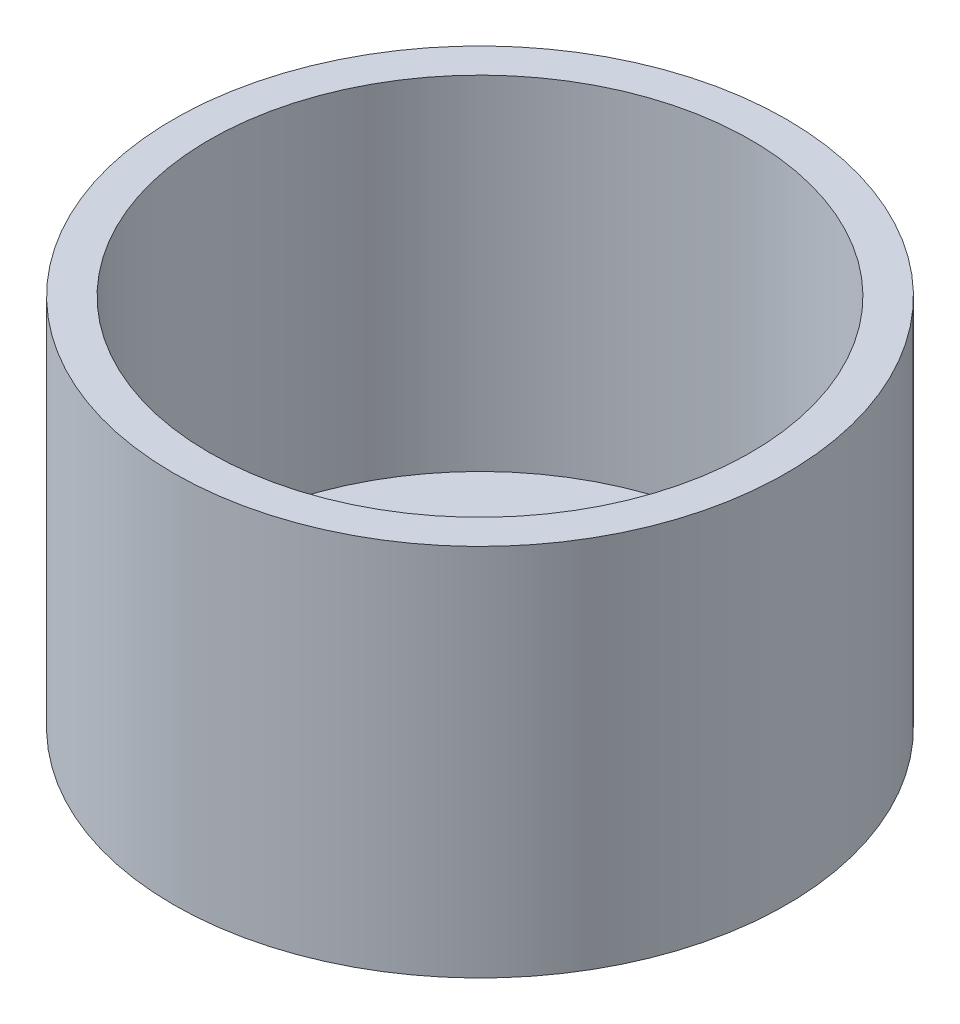
ISO-10303-21;
HEADER;
FILE_DESCRIPTION(('STEP AP214'),'2;1');
FILE_NAME('part.step','',(''),(''),'','','');
FILE_SCHEMA(('AUTOMOTIVE_DESIGN { 1 0 10303 214 1 1 1 1 }'));
ENDSEC;
DATA;
#1=APPLICATION_CONTEXT('core data for automotive mechanical design processes');
#2=APPLICATION_PROTOCOL_DEFINITION('international standard','automotive_design',2000,#1);
#3=PRODUCT_CONTEXT('',#1,'mechanical');
#4=PRODUCT('Part','Part','',(#3));
#5=PRODUCT_RELATED_PRODUCT_CATEGORY('part','',(#4));
#6=PRODUCT_DEFINITION_FORMATION('','',#4);
#7=PRODUCT_DEFINITION_CONTEXT('part definition',#1,'design');
#8=PRODUCT_DEFINITION('design','',#6,#7);
#9=PRODUCT_DEFINITION_SHAPE('','',#8);
#10=(LENGTH_UNIT() NAMED_UNIT(*) SI_UNIT(.MILLI.,.METRE.));
#11=(NAMED_UNIT(*) PLANE_ANGLE_UNIT() SI_UNIT($,.RADIAN.));
#12=(NAMED_UNIT(*) SI_UNIT($,.STERADIAN.) SOLID_ANGLE_UNIT());
#13=UNCERTAINTY_MEASURE_WITH_UNIT(LENGTH_MEASURE(1.E-05),#10,'distance_accuracy_value','');
#14=(GEOMETRIC_REPRESENTATION_CONTEXT(3) GLOBAL_UNCERTAINTY_ASSIGNED_CONTEXT((#13)) GLOBAL_UNIT_ASSIGNED_CONTEXT((#10,
#11,#12)) REPRESENTATION_CONTEXT('',''));
#15=CARTESIAN_POINT('',(0.,0.,0.));
#16=DIRECTION('',(0.,0.,1.));
#17=DIRECTION('',(1.,0.,0.));
#18=AXIS2_PLACEMENT_3D('',#15,#16,#17);
#19=CARTESIAN_POINT('',(0.,57.15,0.));
#20=DIRECTION('',(0.,1.,0.));
#21=DIRECTION('',(0.,0.,1.));
#22=AXIS2_PLACEMENT_3D('',#19,#20,#21);
#23=PLANE('',#22);
#24=CARTESIAN_POINT('',(0.,57.15,0.));
#25=DIRECTION('',(0.,1.,0.));
#26=DIRECTION('',(0.,0.,1.));
#27=AXIS2_PLACEMENT_3D('',#24,#25,#26);
#28=CIRCLE('',#27,51.0286);
#29=CARTESIAN_POINT('',(0.,57.15,51.0286));
#30=VERTEX_POINT('',#29);
#31=EDGE_CURVE('E10',#30,#30,#28,.T.);
#32=ORIENTED_EDGE('',*,*,#31,.T.);
#33=EDGE_LOOP('',(#32));
#34=FACE_BOUND('',#33,.T.);
#35=CARTESIAN_POINT('',(0.,57.15,0.));
#36=DIRECTION('',(0.,1.,0.));
#37=DIRECTION('',(0.,0.,1.));
#38=AXIS2_PLACEMENT_3D('',#35,#36,#37);
#39=CIRCLE('',#38,45.085);
#40=CARTESIAN_POINT('',(0.,57.15,45.085));
#41=VERTEX_POINT('',#40);
#42=EDGE_CURVE('E38',#41,#41,#39,.T.);
#43=ORIENTED_EDGE('',*,*,#42,.F.);
#44=EDGE_LOOP('',(#43));
#45=FACE_BOUND('',#44,.T.);
#46=ADVANCED_FACE('F30',(#34,#45),#23,.T.);
#47=CARTESIAN_POINT('',(0.,57.15,0.));
#48=DIRECTION('',(0.,-1.,0.));
#49=DIRECTION('',(0.,0.,-1.));
#50=AXIS2_PLACEMENT_3D('',#47,#48,#49);
#51=CYLINDRICAL_SURFACE('',#50,51.0286);
#52=ORIENTED_EDGE('',*,*,#31,.F.);
#53=EDGE_LOOP('',(#52));
#54=FACE_BOUND('',#53,.T.);
#55=CARTESIAN_POINT('',(0.,-5.08,0.));
#56=DIRECTION('',(0.,-1.,0.));
#57=DIRECTION('',(0.,0.,-1.));
#58=AXIS2_PLACEMENT_3D('',#55,#56,#57);
#59=CIRCLE('',#58,51.0286);
#60=CARTESIAN_POINT('',(0.,-5.08,-51.0286));
#61=VERTEX_POINT('',#60);
#62=EDGE_CURVE('E119',#61,#61,#59,.T.);
#63=ORIENTED_EDGE('',*,*,#62,.F.);
#64=EDGE_LOOP('',(#63));
#65=FACE_BOUND('',#64,.T.);
#66=ADVANCED_FACE('F32',(#54,#65),#51,.T.);
#67=CARTESIAN_POINT('',(0.,57.15,0.));
#68=DIRECTION('',(0.,-1.,0.));
#69=DIRECTION('',(0.,0.,-1.));
#70=AXIS2_PLACEMENT_3D('',#67,#68,#69);
#71=CYLINDRICAL_SURFACE('',#70,45.085);
#72=ORIENTED_EDGE('',*,*,#42,.T.);
#73=EDGE_LOOP('',(#72));
#74=FACE_BOUND('',#73,.T.);
#75=CARTESIAN_POINT('',(0.,0.,0.));
#76=DIRECTION('',(0.,1.,0.));
#77=DIRECTION('',(0.,0.,1.));
#78=AXIS2_PLACEMENT_3D('',#75,#76,#77);
#79=CIRCLE('',#78,45.085);
#80=CARTESIAN_POINT('',(0.,0.,45.085));
#81=VERTEX_POINT('',#80);
#82=EDGE_CURVE('E43',#81,#81,#79,.T.);
#83=ORIENTED_EDGE('',*,*,#82,.F.);
#84=EDGE_LOOP('',(#83));
#85=FACE_BOUND('',#84,.T.);
#86=ADVANCED_FACE('F128',(#74,#85),#71,.F.);
#87=CARTESIAN_POINT('',(0.,0.,0.));
#88=DIRECTION('',(0.,-1.,0.));
#89=DIRECTION('',(0.,0.,-1.));
#90=AXIS2_PLACEMENT_3D('',#87,#88,#89);
#91=PLANE('',#90);
#92=CARTESIAN_POINT('',(14.050000033,0.,-7.35000003199999));
#93=DIRECTION('',(0.,-1.,0.));
#94=DIRECTION('',(0.,0.,-1.));
#95=AXIS2_PLACEMENT_3D('',#92,#93,#94);
#96=CIRCLE('',#95,1.);
#97=CARTESIAN_POINT('',(14.050000033,0.,-8.35000003199999));
#98=VERTEX_POINT('',#97);
#99=EDGE_CURVE('E116',#98,#98,#96,.T.);
#100=ORIENTED_EDGE('',*,*,#99,.T.);
#101=EDGE_LOOP('',(#100));
#102=FACE_BOUND('',#101,.T.);
#103=CARTESIAN_POINT('',(14.050000033,0.,-12.350000032));
#104=DIRECTION('',(0.,-1.,0.));
#105=DIRECTION('',(0.,0.,-1.));
#106=AXIS2_PLACEMENT_3D('',#103,#104,#105);
#107=CIRCLE('',#106,1.);
#108=CARTESIAN_POINT('',(14.050000033,0.,-13.350000032));
#109=VERTEX_POINT('',#108);
#110=EDGE_CURVE('E104',#109,#109,#107,.T.);
#111=ORIENTED_EDGE('',*,*,#110,.T.);
#112=EDGE_LOOP('',(#111));
#113=FACE_BOUND('',#112,.T.);
#114=CARTESIAN_POINT('',(-14.049999967,0.,-12.350000032));
#115=DIRECTION('',(0.,-1.,0.));
#116=DIRECTION('',(0.,0.,-1.));
#117=AXIS2_PLACEMENT_3D('',#114,#115,#116);
#118=CIRCLE('',#117,0.999999999999998);
#119=CARTESIAN_POINT('',(-14.049999967,0.,-13.350000032));
#120=VERTEX_POINT('',#119);
#121=EDGE_CURVE('E101',#120,#120,#118,.T.);
#122=ORIENTED_EDGE('',*,*,#121,.T.);
#123=EDGE_LOOP('',(#122));
#124=FACE_BOUND('',#123,.T.);
#125=CARTESIAN_POINT('',(-19.049999967,0.,-12.350000032));
#126=DIRECTION('',(0.,-1.,0.));
#127=DIRECTION('',(0.,0.,-1.));
#128=AXIS2_PLACEMENT_3D('',#125,#126,#127);
#129=CIRCLE('',#128,0.999999999999998);
#130=CARTESIAN_POINT('',(-19.049999967,0.,-13.350000032));
#131=VERTEX_POINT('',#130);
#132=EDGE_CURVE('E98',#131,#131,#129,.T.);
#133=ORIENTED_EDGE('',*,*,#132,.T.);
#134=EDGE_LOOP('',(#133));
#135=FACE_BOUND('',#134,.T.);
#136=CARTESIAN_POINT('',(-19.049999967,0.,-7.35000003199999));
#137=DIRECTION('',(0.,-1.,0.));
#138=DIRECTION('',(0.,0.,-1.));
#139=AXIS2_PLACEMENT_3D('',#136,#137,#138);
#140=CIRCLE('',#139,0.999999999999998);
#141=CARTESIAN_POINT('',(-19.049999967,0.,-8.35000003199999));
#142=VERTEX_POINT('',#141);
#143=EDGE_CURVE('E94',#142,#142,#140,.T.);
#144=ORIENTED_EDGE('',*,*,#143,.T.);
#145=EDGE_LOOP('',(#144));
#146=FACE_BOUND('',#145,.T.);
#147=CARTESIAN_POINT('',(-19.049999967,0.,7.34999996800005));
#148=DIRECTION('',(0.,-1.,0.));
#149=DIRECTION('',(0.,0.,-1.));
#150=AXIS2_PLACEMENT_3D('',#147,#148,#149);
#151=CIRCLE('',#150,0.999999999999998);
#152=CARTESIAN_POINT('',(-19.049999967,0.,6.34999996800006));
#153=VERTEX_POINT('',#152);
#154=EDGE_CURVE('E90',#153,#153,#151,.T.);
#155=ORIENTED_EDGE('',*,*,#154,.T.);
#156=EDGE_LOOP('',(#155));
#157=FACE_BOUND('',#156,.T.);
#158=CARTESIAN_POINT('',(-19.049999967,0.,12.349999968));
#159=DIRECTION('',(0.,-1.,0.));
#160=DIRECTION('',(0.,0.,-1.));
#161=AXIS2_PLACEMENT_3D('',#158,#159,#160);
#162=CIRCLE('',#161,0.999999999999998);
#163=CARTESIAN_POINT('',(-19.049999967,0.,11.349999968));
#164=VERTEX_POINT('',#163);
#165=EDGE_CURVE('E86',#164,#164,#162,.T.);
#166=ORIENTED_EDGE('',*,*,#165,.T.);
#167=EDGE_LOOP('',(#166));
#168=FACE_BOUND('',#167,.T.);
#169=CARTESIAN_POINT('',(-14.049999967,0.,12.349999968));
#170=DIRECTION('',(0.,-1.,0.));
#171=DIRECTION('',(0.,0.,-1.));
#172=AXIS2_PLACEMENT_3D('',#169,#170,#171);
#173=CIRCLE('',#172,1.00000000000001);
#174=CARTESIAN_POINT('',(-14.049999967,0.,11.349999968));
#175=VERTEX_POINT('',#174);
#176=EDGE_CURVE('E82',#175,#175,#173,.T.);
#177=ORIENTED_EDGE('',*,*,#176,.T.);
#178=EDGE_LOOP('',(#177));
#179=FACE_BOUND('',#178,.T.);
#180=CARTESIAN_POINT('',(-14.049999967,0.,-7.350000032));
#181=DIRECTION('',(0.,-1.,0.));
#182=DIRECTION('',(0.,0.,-1.));
#183=AXIS2_PLACEMENT_3D('',#180,#181,#182);
#184=CIRCLE('',#183,0.999999999999998);
#185=CARTESIAN_POINT('',(-14.049999967,0.,-8.350000032));
#186=VERTEX_POINT('',#185);
#187=EDGE_CURVE('E78',#186,#186,#184,.T.);
#188=ORIENTED_EDGE('',*,*,#187,.T.);
#189=EDGE_LOOP('',(#188));
#190=FACE_BOUND('',#189,.T.);
#191=CARTESIAN_POINT('',(19.050000033,0.,12.349999968));
#192=DIRECTION('',(0.,-1.,0.));
#193=DIRECTION('',(0.,0.,-1.));
#194=AXIS2_PLACEMENT_3D('',#191,#192,#193);
#195=CIRCLE('',#194,1.);
#196=CARTESIAN_POINT('',(19.050000033,0.,11.349999968));
#197=VERTEX_POINT('',#196);
#198=EDGE_CURVE('E74',#197,#197,#195,.T.);
#199=ORIENTED_EDGE('',*,*,#198,.T.);
#200=EDGE_LOOP('',(#199));
#201=FACE_BOUND('',#200,.T.);
#202=CARTESIAN_POINT('',(14.050000033,0.,12.349999968));
#203=DIRECTION('',(0.,-1.,0.));
#204=DIRECTION('',(0.,0.,-1.));
#205=AXIS2_PLACEMENT_3D('',#202,#203,#204);
#206=CIRCLE('',#205,0.999999999999984);
#207=CARTESIAN_POINT('',(14.050000033,0.,11.349999968));
#208=VERTEX_POINT('',#207);
#209=EDGE_CURVE('E70',#208,#208,#206,.T.);
#210=ORIENTED_EDGE('',*,*,#209,.T.);
#211=EDGE_LOOP('',(#210));
#212=FACE_BOUND('',#211,.T.);
#213=CARTESIAN_POINT('',(14.050000033,0.,7.34999996800004));
#214=DIRECTION('',(0.,-1.,0.));
#215=DIRECTION('',(0.,0.,-1.));
#216=AXIS2_PLACEMENT_3D('',#213,#214,#215);
#217=CIRCLE('',#216,1.);
#218=CARTESIAN_POINT('',(14.050000033,0.,6.34999996800004));
#219=VERTEX_POINT('',#218);
#220=EDGE_CURVE('E66',#219,#219,#217,.T.);
#221=ORIENTED_EDGE('',*,*,#220,.T.);
#222=EDGE_LOOP('',(#221));
#223=FACE_BOUND('',#222,.T.);
#224=CARTESIAN_POINT('',(19.050000033,0.,7.34999996800004));
#225=DIRECTION('',(0.,-1.,0.));
#226=DIRECTION('',(0.,0.,-1.));
#227=AXIS2_PLACEMENT_3D('',#224,#225,#226);
#228=CIRCLE('',#227,1.);
#229=CARTESIAN_POINT('',(19.050000033,0.,6.34999996800004));
#230=VERTEX_POINT('',#229);
#231=EDGE_CURVE('E62',#230,#230,#228,.T.);
#232=ORIENTED_EDGE('',*,*,#231,.T.);
#233=EDGE_LOOP('',(#232));
#234=FACE_BOUND('',#233,.T.);
#235=CARTESIAN_POINT('',(19.050000033,0.,-7.35000003199998));
#236=DIRECTION('',(0.,-1.,0.));
#237=DIRECTION('',(0.,0.,-1.));
#238=AXIS2_PLACEMENT_3D('',#235,#236,#237);
#239=CIRCLE('',#238,0.999999999999998);
#240=CARTESIAN_POINT('',(19.050000033,0.,-8.35000003199998));
#241=VERTEX_POINT('',#240);
#242=EDGE_CURVE('E58',#241,#241,#239,.T.);
#243=ORIENTED_EDGE('',*,*,#242,.T.);
#244=EDGE_LOOP('',(#243));
#245=FACE_BOUND('',#244,.T.);
#246=CARTESIAN_POINT('',(19.050000033,0.,-12.350000032));
#247=DIRECTION('',(0.,-1.,0.));
#248=DIRECTION('',(0.,0.,-1.));
#249=AXIS2_PLACEMENT_3D('',#246,#247,#248);
#250=CIRCLE('',#249,1.);
#251=CARTESIAN_POINT('',(19.050000033,0.,-13.350000032));
#252=VERTEX_POINT('',#251);
#253=EDGE_CURVE('E54',#252,#252,#250,.T.);
#254=ORIENTED_EDGE('',*,*,#253,.T.);
#255=EDGE_LOOP('',(#254));
#256=FACE_BOUND('',#255,.T.);
#257=CARTESIAN_POINT('',(-14.049999967,0.,7.34999996800005));
#258=DIRECTION('',(0.,-1.,0.));
#259=DIRECTION('',(0.,0.,-1.));
#260=AXIS2_PLACEMENT_3D('',#257,#258,#259);
#261=CIRCLE('',#260,1.00000000000001);
#262=CARTESIAN_POINT('',(-14.049999967,0.,6.34999996800004));
#263=VERTEX_POINT('',#262);
#264=EDGE_CURVE('E50',#263,#263,#261,.T.);
#265=ORIENTED_EDGE('',*,*,#264,.T.);
#266=EDGE_LOOP('',(#265));
#267=FACE_BOUND('',#266,.T.);
#268=ORIENTED_EDGE('',*,*,#82,.T.);
#269=EDGE_LOOP('',(#268));
#270=FACE_BOUND('',#269,.T.);
#271=ADVANCED_FACE('F126',(#102,#113,#124,#135,#146,#157,#168,#179,#190,#201,#212,#223,#234,
#245,#256,#267,#270),#91,.F.);
#272=CARTESIAN_POINT('',(0.,-5.08,0.));
#273=DIRECTION('',(0.,-1.,0.));
#274=DIRECTION('',(0.,0.,-1.));
#275=AXIS2_PLACEMENT_3D('',#272,#273,#274);
#276=PLANE('',#275);
#277=CARTESIAN_POINT('',(14.050000033,-5.08,-7.35000003199999));
#278=DIRECTION('',(0.,-1.,0.));
#279=DIRECTION('',(0.,0.,-1.));
#280=AXIS2_PLACEMENT_3D('',#277,#278,#279);
#281=CIRCLE('',#280,1.);
#282=CARTESIAN_POINT('',(14.050000033,-5.08,-8.35000003199999));
#283=VERTEX_POINT('',#282);
#284=EDGE_CURVE('E34',#283,#283,#281,.T.);
#285=ORIENTED_EDGE('',*,*,#284,.F.);
#286=EDGE_LOOP('',(#285));
#287=FACE_BOUND('',#286,.T.);
#288=CARTESIAN_POINT('',(14.050000033,-5.08,-12.350000032));
#289=DIRECTION('',(0.,-1.,0.));
#290=DIRECTION('',(0.,0.,-1.));
#291=AXIS2_PLACEMENT_3D('',#288,#289,#290);
#292=CIRCLE('',#291,1.);
#293=CARTESIAN_POINT('',(14.050000033,-5.08,-13.350000032));
#294=VERTEX_POINT('',#293);
#295=EDGE_CURVE('E102',#294,#294,#292,.T.);
#296=ORIENTED_EDGE('',*,*,#295,.F.);
#297=EDGE_LOOP('',(#296));
#298=FACE_BOUND('',#297,.T.);
#299=CARTESIAN_POINT('',(-14.049999967,-5.08,-12.350000032));
#300=DIRECTION('',(0.,-1.,0.));
#301=DIRECTION('',(0.,0.,-1.));
#302=AXIS2_PLACEMENT_3D('',#299,#300,#301);
#303=CIRCLE('',#302,0.999999999999998);
#304=CARTESIAN_POINT('',(-14.049999967,-5.08,-13.350000032));
#305=VERTEX_POINT('',#304);
#306=EDGE_CURVE('E99',#305,#305,#303,.T.);
#307=ORIENTED_EDGE('',*,*,#306,.F.);
#308=EDGE_LOOP('',(#307));
#309=FACE_BOUND('',#308,.T.);
#310=CARTESIAN_POINT('',(-19.049999967,-5.08,-12.350000032));
#311=DIRECTION('',(0.,-1.,0.));
#312=DIRECTION('',(0.,0.,-1.));
#313=AXIS2_PLACEMENT_3D('',#310,#311,#312);
#314=CIRCLE('',#313,0.999999999999998);
#315=CARTESIAN_POINT('',(-19.049999967,-5.08,-13.350000032));
#316=VERTEX_POINT('',#315);
#317=EDGE_CURVE('E95',#316,#316,#314,.T.);
#318=ORIENTED_EDGE('',*,*,#317,.F.);
#319=EDGE_LOOP('',(#318));
#320=FACE_BOUND('',#319,.T.);
#321=CARTESIAN_POINT('',(-19.049999967,-5.08,-7.35000003199999));
#322=DIRECTION('',(0.,-1.,0.));
#323=DIRECTION('',(0.,0.,-1.));
#324=AXIS2_PLACEMENT_3D('',#321,#322,#323);
#325=CIRCLE('',#324,0.999999999999998);
#326=CARTESIAN_POINT('',(-19.049999967,-5.08,-8.35000003199999));
#327=VERTEX_POINT('',#326);
#328=EDGE_CURVE('E91',#327,#327,#325,.T.);
#329=ORIENTED_EDGE('',*,*,#328,.F.);
#330=EDGE_LOOP('',(#329));
#331=FACE_BOUND('',#330,.T.);
#332=CARTESIAN_POINT('',(-19.049999967,-5.08,7.34999996800005));
#333=DIRECTION('',(0.,-1.,0.));
#334=DIRECTION('',(0.,0.,-1.));
#335=AXIS2_PLACEMENT_3D('',#332,#333,#334);
#336=CIRCLE('',#335,0.999999999999998);
#337=CARTESIAN_POINT('',(-19.049999967,-5.08,6.34999996800006));
#338=VERTEX_POINT('',#337);
#339=EDGE_CURVE('E87',#338,#338,#336,.T.);
#340=ORIENTED_EDGE('',*,*,#339,.F.);
#341=EDGE_LOOP('',(#340));
#342=FACE_BOUND('',#341,.T.);
#343=CARTESIAN_POINT('',(-19.049999967,-5.08,12.349999968));
#344=DIRECTION('',(0.,-1.,0.));
#345=DIRECTION('',(0.,0.,-1.));
#346=AXIS2_PLACEMENT_3D('',#343,#344,#345);
#347=CIRCLE('',#346,0.999999999999998);
#348=CARTESIAN_POINT('',(-19.049999967,-5.08,11.349999968));
#349=VERTEX_POINT('',#348);
#350=EDGE_CURVE('E83',#349,#349,#347,.T.);
#351=ORIENTED_EDGE('',*,*,#350,.F.);
#352=EDGE_LOOP('',(#351));
#353=FACE_BOUND('',#352,.T.);
#354=CARTESIAN_POINT('',(-14.049999967,-5.08,12.349999968));
#355=DIRECTION('',(0.,-1.,0.));
#356=DIRECTION('',(0.,0.,-1.));
#357=AXIS2_PLACEMENT_3D('',#354,#355,#356);
#358=CIRCLE('',#357,1.00000000000001);
#359=CARTESIAN_POINT('',(-14.049999967,-5.08,11.349999968));
#360=VERTEX_POINT('',#359);
#361=EDGE_CURVE('E79',#360,#360,#358,.T.);
#362=ORIENTED_EDGE('',*,*,#361,.F.);
#363=EDGE_LOOP('',(#362));
#364=FACE_BOUND('',#363,.T.);
#365=CARTESIAN_POINT('',(-14.049999967,-5.08,-7.350000032));
#366=DIRECTION('',(0.,-1.,0.));
#367=DIRECTION('',(0.,0.,-1.));
#368=AXIS2_PLACEMENT_3D('',#365,#366,#367);
#369=CIRCLE('',#368,0.999999999999998);
#370=CARTESIAN_POINT('',(-14.049999967,-5.08,-8.350000032));
#371=VERTEX_POINT('',#370);
#372=EDGE_CURVE('E75',#371,#371,#369,.T.);
#373=ORIENTED_EDGE('',*,*,#372,.F.);
#374=EDGE_LOOP('',(#373));
#375=FACE_BOUND('',#374,.T.);
#376=CARTESIAN_POINT('',(19.050000033,-5.08,12.349999968));
#377=DIRECTION('',(0.,-1.,0.));
#378=DIRECTION('',(0.,0.,-1.));
#379=AXIS2_PLACEMENT_3D('',#376,#377,#378);
#380=CIRCLE('',#379,1.);
#381=CARTESIAN_POINT('',(19.050000033,-5.08,11.349999968));
#382=VERTEX_POINT('',#381);
#383=EDGE_CURVE('E71',#382,#382,#380,.T.);
#384=ORIENTED_EDGE('',*,*,#383,.F.);
#385=EDGE_LOOP('',(#384));
#386=FACE_BOUND('',#385,.T.);
#387=CARTESIAN_POINT('',(14.050000033,-5.08,12.349999968));
#388=DIRECTION('',(0.,-1.,0.));
#389=DIRECTION('',(0.,0.,-1.));
#390=AXIS2_PLACEMENT_3D('',#387,#388,#389);
#391=CIRCLE('',#390,0.999999999999984);
#392=CARTESIAN_POINT('',(14.050000033,-5.08,11.349999968));
#393=VERTEX_POINT('',#392);
#394=EDGE_CURVE('E67',#393,#393,#391,.T.);
#395=ORIENTED_EDGE('',*,*,#394,.F.);
#396=EDGE_LOOP('',(#395));
#397=FACE_BOUND('',#396,.T.);
#398=CARTESIAN_POINT('',(14.050000033,-5.08,7.34999996800004));
#399=DIRECTION('',(0.,-1.,0.));
#400=DIRECTION('',(0.,0.,-1.));
#401=AXIS2_PLACEMENT_3D('',#398,#399,#400);
#402=CIRCLE('',#401,1.);
#403=CARTESIAN_POINT('',(14.050000033,-5.08,6.34999996800004));
#404=VERTEX_POINT('',#403);
#405=EDGE_CURVE('E63',#404,#404,#402,.T.);
#406=ORIENTED_EDGE('',*,*,#405,.F.);
#407=EDGE_LOOP('',(#406));
#408=FACE_BOUND('',#407,.T.);
#409=CARTESIAN_POINT('',(19.050000033,-5.08,7.34999996800004));
#410=DIRECTION('',(0.,-1.,0.));
#411=DIRECTION('',(0.,0.,-1.));
#412=AXIS2_PLACEMENT_3D('',#409,#410,#411);
#413=CIRCLE('',#412,1.);
#414=CARTESIAN_POINT('',(19.050000033,-5.08,6.34999996800004));
#415=VERTEX_POINT('',#414);
#416=EDGE_CURVE('E59',#415,#415,#413,.T.);
#417=ORIENTED_EDGE('',*,*,#416,.F.);
#418=EDGE_LOOP('',(#417));
#419=FACE_BOUND('',#418,.T.);
#420=CARTESIAN_POINT('',(19.050000033,-5.08,-7.35000003199998));
#421=DIRECTION('',(0.,-1.,0.));
#422=DIRECTION('',(0.,0.,-1.));
#423=AXIS2_PLACEMENT_3D('',#420,#421,#422);
#424=CIRCLE('',#423,0.999999999999998);
#425=CARTESIAN_POINT('',(19.050000033,-5.08,-8.35000003199998));
#426=VERTEX_POINT('',#425);
#427=EDGE_CURVE('E55',#426,#426,#424,.T.);
#428=ORIENTED_EDGE('',*,*,#427,.F.);
#429=EDGE_LOOP('',(#428));
#430=FACE_BOUND('',#429,.T.);
#431=CARTESIAN_POINT('',(19.050000033,-5.08,-12.350000032));
#432=DIRECTION('',(0.,-1.,0.));
#433=DIRECTION('',(0.,0.,-1.));
#434=AXIS2_PLACEMENT_3D('',#431,#432,#433);
#435=CIRCLE('',#434,1.);
#436=CARTESIAN_POINT('',(19.050000033,-5.08,-13.350000032));
#437=VERTEX_POINT('',#436);
#438=EDGE_CURVE('E51',#437,#437,#435,.T.);
#439=ORIENTED_EDGE('',*,*,#438,.F.);
#440=EDGE_LOOP('',(#439));
#441=FACE_BOUND('',#440,.T.);
#442=CARTESIAN_POINT('',(-14.049999967,-5.08,7.34999996800005));
#443=DIRECTION('',(0.,-1.,0.));
#444=DIRECTION('',(0.,0.,-1.));
#445=AXIS2_PLACEMENT_3D('',#442,#443,#444);
#446=CIRCLE('',#445,1.00000000000001);
#447=CARTESIAN_POINT('',(-14.049999967,-5.08,6.34999996800004));
#448=VERTEX_POINT('',#447);
#449=EDGE_CURVE('E47',#448,#448,#446,.T.);
#450=ORIENTED_EDGE('',*,*,#449,.F.);
#451=EDGE_LOOP('',(#450));
#452=FACE_BOUND('',#451,.T.);
#453=ORIENTED_EDGE('',*,*,#62,.T.);
#454=EDGE_LOOP('',(#453));
#455=FACE_BOUND('',#454,.T.);
#456=ADVANCED_FACE('F136',(#287,#298,#309,#320,#331,#342,#353,#364,#375,#386,#397,#408,#419,
#430,#441,#452,#455),#276,.T.);
#457=CARTESIAN_POINT('',(-14.049999967,57.15,7.34999996800005));
#458=DIRECTION('',(0.,-1.,0.));
#459=DIRECTION('',(0.,0.,-1.));
#460=AXIS2_PLACEMENT_3D('',#457,#458,#459);
#461=CYLINDRICAL_SURFACE('',#460,1.00000000000001);
#462=ORIENTED_EDGE('',*,*,#449,.T.);
#463=EDGE_LOOP('',(#462));
#464=FACE_BOUND('',#463,.T.);
#465=ORIENTED_EDGE('',*,*,#264,.F.);
#466=EDGE_LOOP('',(#465));
#467=FACE_BOUND('',#466,.T.);
#468=ADVANCED_FACE('F167',(#464,#467),#461,.F.);
#469=CARTESIAN_POINT('',(19.050000033,57.15,-12.350000032));
#470=DIRECTION('',(0.,-1.,0.));
#471=DIRECTION('',(0.,0.,-1.));
#472=AXIS2_PLACEMENT_3D('',#469,#470,#471);
#473=CYLINDRICAL_SURFACE('',#472,1.);
#474=ORIENTED_EDGE('',*,*,#438,.T.);
#475=EDGE_LOOP('',(#474));
#476=FACE_BOUND('',#475,.T.);
#477=ORIENTED_EDGE('',*,*,#253,.F.);
#478=EDGE_LOOP('',(#477));
#479=FACE_BOUND('',#478,.T.);
#480=ADVANCED_FACE('F177',(#476,#479),#473,.F.);
#481=CARTESIAN_POINT('',(19.050000033,57.15,-7.35000003199998));
#482=DIRECTION('',(0.,-1.,0.));
#483=DIRECTION('',(0.,0.,-1.));
#484=AXIS2_PLACEMENT_3D('',#481,#482,#483);
#485=CYLINDRICAL_SURFACE('',#484,0.999999999999998);
#486=ORIENTED_EDGE('',*,*,#427,.T.);
#487=EDGE_LOOP('',(#486));
#488=FACE_BOUND('',#487,.T.);
#489=ORIENTED_EDGE('',*,*,#242,.F.);
#490=EDGE_LOOP('',(#489));
#491=FACE_BOUND('',#490,.T.);
#492=ADVANCED_FACE('F187',(#488,#491),#485,.F.);
#493=CARTESIAN_POINT('',(19.050000033,57.15,7.34999996800004));
#494=DIRECTION('',(0.,-1.,0.));
#495=DIRECTION('',(0.,0.,-1.));
#496=AXIS2_PLACEMENT_3D('',#493,#494,#495);
#497=CYLINDRICAL_SURFACE('',#496,1.);
#498=ORIENTED_EDGE('',*,*,#416,.T.);
#499=EDGE_LOOP('',(#498));
#500=FACE_BOUND('',#499,.T.);
#501=ORIENTED_EDGE('',*,*,#231,.F.);
#502=EDGE_LOOP('',(#501));
#503=FACE_BOUND('',#502,.T.);
#504=ADVANCED_FACE('F197',(#500,#503),#497,.F.);
#505=CARTESIAN_POINT('',(14.050000033,57.15,7.34999996800004));
#506=DIRECTION('',(0.,-1.,0.));
#507=DIRECTION('',(0.,0.,-1.));
#508=AXIS2_PLACEMENT_3D('',#505,#506,#507);
#509=CYLINDRICAL_SURFACE('',#508,1.);
#510=ORIENTED_EDGE('',*,*,#405,.T.);
#511=EDGE_LOOP('',(#510));
#512=FACE_BOUND('',#511,.T.);
#513=ORIENTED_EDGE('',*,*,#220,.F.);
#514=EDGE_LOOP('',(#513));
#515=FACE_BOUND('',#514,.T.);
#516=ADVANCED_FACE('F207',(#512,#515),#509,.F.);
#517=CARTESIAN_POINT('',(14.050000033,57.15,12.349999968));
#518=DIRECTION('',(0.,-1.,0.));
#519=DIRECTION('',(0.,0.,-1.));
#520=AXIS2_PLACEMENT_3D('',#517,#518,#519);
#521=CYLINDRICAL_SURFACE('',#520,0.999999999999984);
#522=ORIENTED_EDGE('',*,*,#394,.T.);
#523=EDGE_LOOP('',(#522));
#524=FACE_BOUND('',#523,.T.);
#525=ORIENTED_EDGE('',*,*,#209,.F.);
#526=EDGE_LOOP('',(#525));
#527=FACE_BOUND('',#526,.T.);
#528=ADVANCED_FACE('F217',(#524,#527),#521,.F.);
#529=CARTESIAN_POINT('',(19.050000033,57.15,12.349999968));
#530=DIRECTION('',(0.,-1.,0.));
#531=DIRECTION('',(0.,0.,-1.));
#532=AXIS2_PLACEMENT_3D('',#529,#530,#531);
#533=CYLINDRICAL_SURFACE('',#532,1.);
#534=ORIENTED_EDGE('',*,*,#383,.T.);
#535=EDGE_LOOP('',(#534));
#536=FACE_BOUND('',#535,.T.);
#537=ORIENTED_EDGE('',*,*,#198,.F.);
#538=EDGE_LOOP('',(#537));
#539=FACE_BOUND('',#538,.T.);
#540=ADVANCED_FACE('F227',(#536,#539),#533,.F.);
#541=CARTESIAN_POINT('',(-14.049999967,57.15,-7.350000032));
#542=DIRECTION('',(0.,-1.,0.));
#543=DIRECTION('',(0.,0.,-1.));
#544=AXIS2_PLACEMENT_3D('',#541,#542,#543);
#545=CYLINDRICAL_SURFACE('',#544,0.999999999999998);
#546=ORIENTED_EDGE('',*,*,#372,.T.);
#547=EDGE_LOOP('',(#546));
#548=FACE_BOUND('',#547,.T.);
#549=ORIENTED_EDGE('',*,*,#187,.F.);
#550=EDGE_LOOP('',(#549));
#551=FACE_BOUND('',#550,.T.);
#552=ADVANCED_FACE('F237',(#548,#551),#545,.F.);
#553=CARTESIAN_POINT('',(-14.049999967,57.15,12.349999968));
#554=DIRECTION('',(0.,-1.,0.));
#555=DIRECTION('',(0.,0.,-1.));
#556=AXIS2_PLACEMENT_3D('',#553,#554,#555);
#557=CYLINDRICAL_SURFACE('',#556,1.00000000000001);
#558=ORIENTED_EDGE('',*,*,#361,.T.);
#559=EDGE_LOOP('',(#558));
#560=FACE_BOUND('',#559,.T.);
#561=ORIENTED_EDGE('',*,*,#176,.F.);
#562=EDGE_LOOP('',(#561));
#563=FACE_BOUND('',#562,.T.);
#564=ADVANCED_FACE('F247',(#560,#563),#557,.F.);
#565=CARTESIAN_POINT('',(-19.049999967,57.15,12.349999968));
#566=DIRECTION('',(0.,-1.,0.));
#567=DIRECTION('',(0.,0.,-1.));
#568=AXIS2_PLACEMENT_3D('',#565,#566,#567);
#569=CYLINDRICAL_SURFACE('',#568,0.999999999999998);
#570=ORIENTED_EDGE('',*,*,#350,.T.);
#571=EDGE_LOOP('',(#570));
#572=FACE_BOUND('',#571,.T.);
#573=ORIENTED_EDGE('',*,*,#165,.F.);
#574=EDGE_LOOP('',(#573));
#575=FACE_BOUND('',#574,.T.);
#576=ADVANCED_FACE('F257',(#572,#575),#569,.F.);
#577=CARTESIAN_POINT('',(-19.049999967,57.15,7.34999996800005));
#578=DIRECTION('',(0.,-1.,0.));
#579=DIRECTION('',(0.,0.,-1.));
#580=AXIS2_PLACEMENT_3D('',#577,#578,#579);
#581=CYLINDRICAL_SURFACE('',#580,0.999999999999998);
#582=ORIENTED_EDGE('',*,*,#339,.T.);
#583=EDGE_LOOP('',(#582));
#584=FACE_BOUND('',#583,.T.);
#585=ORIENTED_EDGE('',*,*,#154,.F.);
#586=EDGE_LOOP('',(#585));
#587=FACE_BOUND('',#586,.T.);
#588=ADVANCED_FACE('F267',(#584,#587),#581,.F.);
#589=CARTESIAN_POINT('',(-19.049999967,57.15,-7.35000003199999));
#590=DIRECTION('',(0.,-1.,0.));
#591=DIRECTION('',(0.,0.,-1.));
#592=AXIS2_PLACEMENT_3D('',#589,#590,#591);
#593=CYLINDRICAL_SURFACE('',#592,0.999999999999998);
#594=ORIENTED_EDGE('',*,*,#328,.T.);
#595=EDGE_LOOP('',(#594));
#596=FACE_BOUND('',#595,.T.);
#597=ORIENTED_EDGE('',*,*,#143,.F.);
#598=EDGE_LOOP('',(#597));
#599=FACE_BOUND('',#598,.T.);
#600=ADVANCED_FACE('F277',(#596,#599),#593,.F.);
#601=CARTESIAN_POINT('',(-19.049999967,57.15,-12.350000032));
#602=DIRECTION('',(0.,-1.,0.));
#603=DIRECTION('',(0.,0.,-1.));
#604=AXIS2_PLACEMENT_3D('',#601,#602,#603);
#605=CYLINDRICAL_SURFACE('',#604,0.999999999999998);
#606=ORIENTED_EDGE('',*,*,#317,.T.);
#607=EDGE_LOOP('',(#606));
#608=FACE_BOUND('',#607,.T.);
#609=ORIENTED_EDGE('',*,*,#132,.F.);
#610=EDGE_LOOP('',(#609));
#611=FACE_BOUND('',#610,.T.);
#612=ADVANCED_FACE('F287',(#608,#611),#605,.F.);
#613=CARTESIAN_POINT('',(-14.049999967,57.15,-12.350000032));
#614=DIRECTION('',(0.,-1.,0.));
#615=DIRECTION('',(0.,0.,-1.));
#616=AXIS2_PLACEMENT_3D('',#613,#614,#615);
#617=CYLINDRICAL_SURFACE('',#616,0.999999999999998);
#618=ORIENTED_EDGE('',*,*,#306,.T.);
#619=EDGE_LOOP('',(#618));
#620=FACE_BOUND('',#619,.T.);
#621=ORIENTED_EDGE('',*,*,#121,.F.);
#622=EDGE_LOOP('',(#621));
#623=FACE_BOUND('',#622,.T.);
#624=ADVANCED_FACE('F297',(#620,#623),#617,.F.);
#625=CARTESIAN_POINT('',(14.050000033,57.15,-12.350000032));
#626=DIRECTION('',(0.,-1.,0.));
#627=DIRECTION('',(0.,0.,-1.));
#628=AXIS2_PLACEMENT_3D('',#625,#626,#627);
#629=CYLINDRICAL_SURFACE('',#628,1.);
#630=ORIENTED_EDGE('',*,*,#295,.T.);
#631=EDGE_LOOP('',(#630));
#632=FACE_BOUND('',#631,.T.);
#633=ORIENTED_EDGE('',*,*,#110,.F.);
#634=EDGE_LOOP('',(#633));
#635=FACE_BOUND('',#634,.T.);
#636=ADVANCED_FACE('F307',(#632,#635),#629,.F.);
#637=CARTESIAN_POINT('',(14.050000033,57.15,-7.35000003199999));
#638=DIRECTION('',(0.,-1.,0.));
#639=DIRECTION('',(0.,0.,-1.));
#640=AXIS2_PLACEMENT_3D('',#637,#638,#639);
#641=CYLINDRICAL_SURFACE('',#640,1.);
#642=ORIENTED_EDGE('',*,*,#284,.T.);
#643=EDGE_LOOP('',(#642));
#644=FACE_BOUND('',#643,.T.);
#645=ORIENTED_EDGE('',*,*,#99,.F.);
#646=EDGE_LOOP('',(#645));
#647=FACE_BOUND('',#646,.T.);
#648=ADVANCED_FACE('F317',(#644,#647),#641,.F.);
#649=CLOSED_SHELL('',(#46,#66,#86,#271,#456,#468,#480,#492,#504,#516,#528,#540,#552,#564,#576,
#588,#600,#612,#624,#636,#648));
#650=MANIFOLD_SOLID_BREP('B2',#649);
#651=ADVANCED_BREP_SHAPE_REPRESENTATION('',(#18,#650),#14);
#652=SHAPE_DEFINITION_REPRESENTATION(#9,#651);
ENDSEC;
END-ISO-10303-21;
